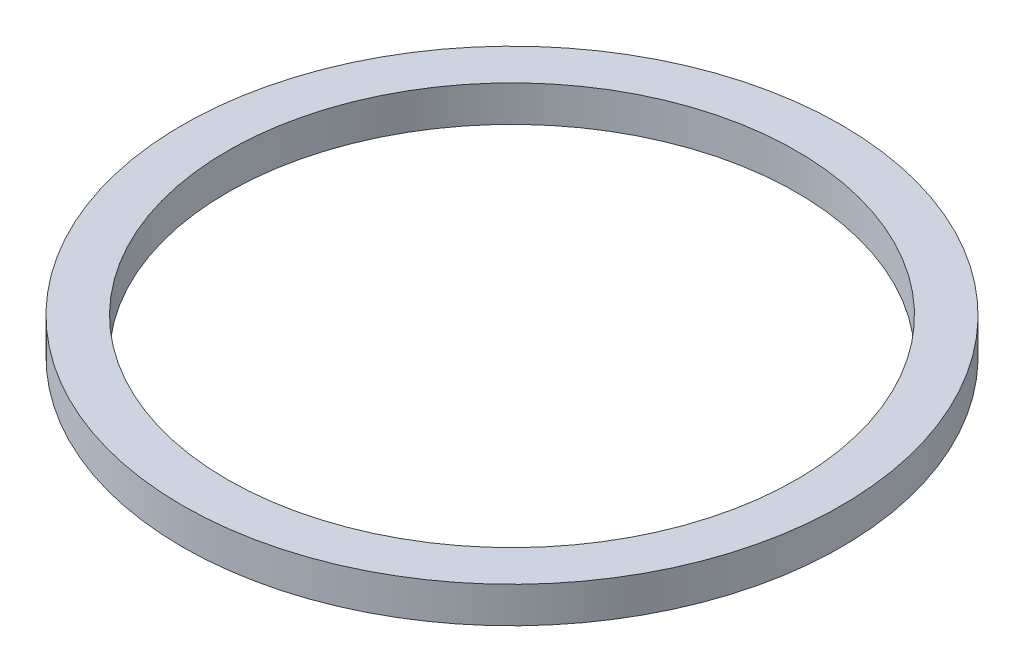
ISO-10303-21;
HEADER;
FILE_DESCRIPTION(('STEP AP214'),'2;1');
FILE_NAME('part.step','',(''),(''),'','','');
FILE_SCHEMA(('AUTOMOTIVE_DESIGN { 1 0 10303 214 1 1 1 1 }'));
ENDSEC;
DATA;
#1=APPLICATION_CONTEXT('core data for automotive mechanical design processes');
#2=APPLICATION_PROTOCOL_DEFINITION('international standard','automotive_design',2000,#1);
#3=PRODUCT_CONTEXT('',#1,'mechanical');
#4=PRODUCT('Part','Part','',(#3));
#5=PRODUCT_RELATED_PRODUCT_CATEGORY('part','',(#4));
#6=PRODUCT_DEFINITION_FORMATION('','',#4);
#7=PRODUCT_DEFINITION_CONTEXT('part definition',#1,'design');
#8=PRODUCT_DEFINITION('design','',#6,#7);
#9=PRODUCT_DEFINITION_SHAPE('','',#8);
#10=(LENGTH_UNIT() NAMED_UNIT(*) SI_UNIT(.MILLI.,.METRE.));
#11=(NAMED_UNIT(*) PLANE_ANGLE_UNIT() SI_UNIT($,.RADIAN.));
#12=(NAMED_UNIT(*) SI_UNIT($,.STERADIAN.) SOLID_ANGLE_UNIT());
#13=UNCERTAINTY_MEASURE_WITH_UNIT(LENGTH_MEASURE(1.E-05),#10,'distance_accuracy_value','');
#14=(GEOMETRIC_REPRESENTATION_CONTEXT(3) GLOBAL_UNCERTAINTY_ASSIGNED_CONTEXT((#13)) GLOBAL_UNIT_ASSIGNED_CONTEXT((#10,
#11,#12)) REPRESENTATION_CONTEXT('',''));
#15=CARTESIAN_POINT('',(0.,0.,0.));
#16=DIRECTION('',(0.,0.,1.));
#17=DIRECTION('',(1.,0.,0.));
#18=AXIS2_PLACEMENT_3D('',#15,#16,#17);
#19=CARTESIAN_POINT('',(0.,6.,0.));
#20=DIRECTION('',(0.,-1.,0.));
#21=DIRECTION('',(0.,0.,-1.));
#22=AXIS2_PLACEMENT_3D('',#19,#20,#21);
#23=CYLINDRICAL_SURFACE('',#22,55.);
#24=CARTESIAN_POINT('',(0.,6.,0.));
#25=DIRECTION('',(0.,1.,0.));
#26=DIRECTION('',(0.,0.,1.));
#27=AXIS2_PLACEMENT_3D('',#24,#25,#26);
#28=CIRCLE('',#27,55.);
#29=CARTESIAN_POINT('',(0.,6.,55.));
#30=VERTEX_POINT('',#29);
#31=EDGE_CURVE('E10',#30,#30,#28,.T.);
#32=ORIENTED_EDGE('',*,*,#31,.F.);
#33=EDGE_LOOP('',(#32));
#34=FACE_BOUND('',#33,.T.);
#35=CARTESIAN_POINT('',(0.,0.,0.));
#36=DIRECTION('',(0.,1.,0.));
#37=DIRECTION('',(0.,0.,1.));
#38=AXIS2_PLACEMENT_3D('',#35,#36,#37);
#39=CIRCLE('',#38,55.);
#40=CARTESIAN_POINT('',(0.,0.,55.));
#41=VERTEX_POINT('',#40);
#42=EDGE_CURVE('E37',#41,#41,#39,.T.);
#43=ORIENTED_EDGE('',*,*,#42,.T.);
#44=EDGE_LOOP('',(#43));
#45=FACE_BOUND('',#44,.T.);
#46=ADVANCED_FACE('F40',(#34,#45),#23,.T.);
#47=CARTESIAN_POINT('',(0.,6.,0.));
#48=DIRECTION('',(0.,1.,0.));
#49=DIRECTION('',(0.,0.,1.));
#50=AXIS2_PLACEMENT_3D('',#47,#48,#49);
#51=PLANE('',#50);
#52=CARTESIAN_POINT('',(0.,6.,0.));
#53=DIRECTION('',(0.,1.,0.));
#54=DIRECTION('',(0.,0.,1.));
#55=AXIS2_PLACEMENT_3D('',#52,#53,#54);
#56=CIRCLE('',#55,47.5);
#57=CARTESIAN_POINT('',(0.,6.,47.5));
#58=VERTEX_POINT('',#57);
#59=EDGE_CURVE('E50',#58,#58,#56,.T.);
#60=ORIENTED_EDGE('',*,*,#59,.F.);
#61=EDGE_LOOP('',(#60));
#62=FACE_BOUND('',#61,.T.);
#63=ORIENTED_EDGE('',*,*,#31,.T.);
#64=EDGE_LOOP('',(#63));
#65=FACE_BOUND('',#64,.T.);
#66=ADVANCED_FACE('F59',(#62,#65),#51,.T.);
#67=CARTESIAN_POINT('',(0.,0.,0.));
#68=DIRECTION('',(0.,1.,0.));
#69=DIRECTION('',(0.,0.,1.));
#70=AXIS2_PLACEMENT_3D('',#67,#68,#69);
#71=PLANE('',#70);
#72=CARTESIAN_POINT('',(0.,0.,0.));
#73=DIRECTION('',(0.,1.,0.));
#74=DIRECTION('',(0.,0.,1.));
#75=AXIS2_PLACEMENT_3D('',#72,#73,#74);
#76=CIRCLE('',#75,47.5);
#77=CARTESIAN_POINT('',(0.,0.,47.5));
#78=VERTEX_POINT('',#77);
#79=EDGE_CURVE('E47',#78,#78,#76,.T.);
#80=ORIENTED_EDGE('',*,*,#79,.T.);
#81=EDGE_LOOP('',(#80));
#82=FACE_BOUND('',#81,.T.);
#83=ORIENTED_EDGE('',*,*,#42,.F.);
#84=EDGE_LOOP('',(#83));
#85=FACE_BOUND('',#84,.T.);
#86=ADVANCED_FACE('F58',(#82,#85),#71,.F.);
#87=CARTESIAN_POINT('',(0.,6.,0.));
#88=DIRECTION('',(0.,-1.,0.));
#89=DIRECTION('',(0.,0.,-1.));
#90=AXIS2_PLACEMENT_3D('',#87,#88,#89);
#91=CYLINDRICAL_SURFACE('',#90,47.5);
#92=ORIENTED_EDGE('',*,*,#59,.T.);
#93=EDGE_LOOP('',(#92));
#94=FACE_BOUND('',#93,.T.);
#95=ORIENTED_EDGE('',*,*,#79,.F.);
#96=EDGE_LOOP('',(#95));
#97=FACE_BOUND('',#96,.T.);
#98=ADVANCED_FACE('F54',(#94,#97),#91,.F.);
#99=CLOSED_SHELL('',(#46,#66,#86,#98));
#100=MANIFOLD_SOLID_BREP('B2',#99);
#101=ADVANCED_BREP_SHAPE_REPRESENTATION('',(#18,#100),#14);
#102=SHAPE_DEFINITION_REPRESENTATION(#9,#101);
ENDSEC;
END-ISO-10303-21;
